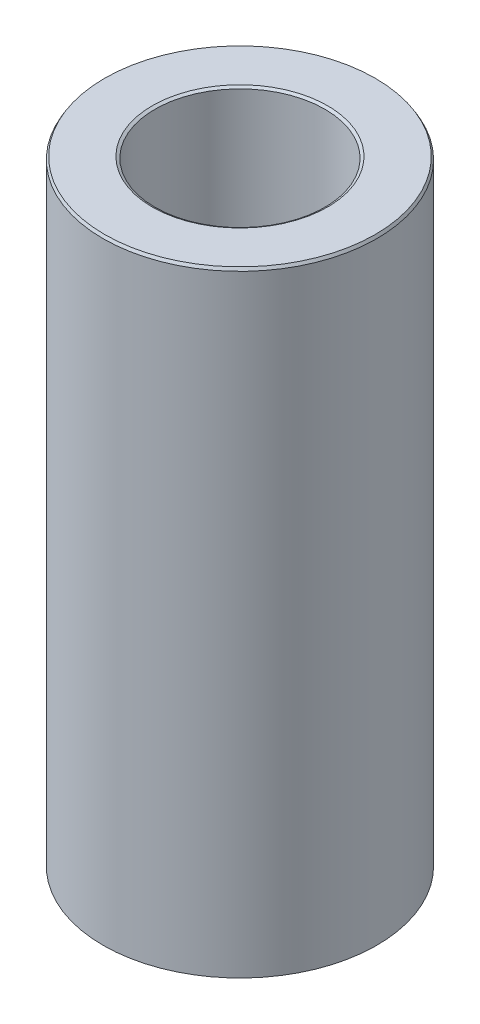
ISO-10303-21;
HEADER;
FILE_DESCRIPTION(('STEP AP214'),'2;1');
FILE_NAME('part.step','',(''),(''),'','','');
FILE_SCHEMA(('AUTOMOTIVE_DESIGN { 1 0 10303 214 1 1 1 1 }'));
ENDSEC;
DATA;
#1=APPLICATION_CONTEXT('core data for automotive mechanical design processes');
#2=APPLICATION_PROTOCOL_DEFINITION('international standard','automotive_design',2000,#1);
#3=PRODUCT_CONTEXT('',#1,'mechanical');
#4=PRODUCT('Part','Part','',(#3));
#5=PRODUCT_RELATED_PRODUCT_CATEGORY('part','',(#4));
#6=PRODUCT_DEFINITION_FORMATION('','',#4);
#7=PRODUCT_DEFINITION_CONTEXT('part definition',#1,'design');
#8=PRODUCT_DEFINITION('design','',#6,#7);
#9=PRODUCT_DEFINITION_SHAPE('','',#8);
#10=(LENGTH_UNIT() NAMED_UNIT(*) SI_UNIT(.MILLI.,.METRE.));
#11=(NAMED_UNIT(*) PLANE_ANGLE_UNIT() SI_UNIT($,.RADIAN.));
#12=(NAMED_UNIT(*) SI_UNIT($,.STERADIAN.) SOLID_ANGLE_UNIT());
#13=UNCERTAINTY_MEASURE_WITH_UNIT(LENGTH_MEASURE(1.E-05),#10,'distance_accuracy_value','');
#14=(GEOMETRIC_REPRESENTATION_CONTEXT(3) GLOBAL_UNCERTAINTY_ASSIGNED_CONTEXT((#13)) GLOBAL_UNIT_ASSIGNED_CONTEXT((#10,
#11,#12)) REPRESENTATION_CONTEXT('',''));
#15=CARTESIAN_POINT('',(0.,0.,0.));
#16=DIRECTION('',(0.,0.,1.));
#17=DIRECTION('',(1.,0.,0.));
#18=AXIS2_PLACEMENT_3D('',#15,#16,#17);
#19=CARTESIAN_POINT('',(0.,270.104100479233,0.));
#20=DIRECTION('',(0.,-1.,0.));
#21=DIRECTION('',(0.,0.,-1.));
#22=AXIS2_PLACEMENT_3D('',#19,#20,#21);
#23=CYLINDRICAL_SURFACE('',#22,60.);
#24=CARTESIAN_POINT('',(0.,0.701481861637765,0.));
#25=DIRECTION('',(0.,1.,0.));
#26=DIRECTION('',(0.,0.,1.));
#27=AXIS2_PLACEMENT_3D('',#24,#25,#26);
#28=CIRCLE('',#27,60.);
#29=CARTESIAN_POINT('',(0.,0.701481861637765,60.));
#30=VERTEX_POINT('',#29);
#31=EDGE_CURVE('E10',#30,#30,#28,.T.);
#32=ORIENTED_EDGE('',*,*,#31,.T.);
#33=EDGE_LOOP('',(#32));
#34=FACE_BOUND('',#33,.T.);
#35=CARTESIAN_POINT('',(0.,268.889098254288,0.));
#36=DIRECTION('',(0.,1.,0.));
#37=DIRECTION('',(0.,0.,1.));
#38=AXIS2_PLACEMENT_3D('',#35,#36,#37);
#39=CIRCLE('',#38,60.);
#40=CARTESIAN_POINT('',(0.,268.889098254288,60.));
#41=VERTEX_POINT('',#40);
#42=EDGE_CURVE('E50',#41,#41,#39,.F.);
#43=ORIENTED_EDGE('',*,*,#42,.T.);
#44=EDGE_LOOP('',(#43));
#45=FACE_BOUND('',#44,.T.);
#46=ADVANCED_FACE('F39',(#34,#45),#23,.T.);
#47=CARTESIAN_POINT('',(0.,270.104100479233,0.));
#48=DIRECTION('',(0.,1.,0.));
#49=DIRECTION('',(0.,0.,1.));
#50=AXIS2_PLACEMENT_3D('',#47,#48,#49);
#51=PLANE('',#50);
#52=CARTESIAN_POINT('',(0.,270.104100479233,0.));
#53=DIRECTION('',(0.,1.,0.));
#54=DIRECTION('',(0.,0.,1.));
#55=AXIS2_PLACEMENT_3D('',#52,#53,#54);
#56=CIRCLE('',#55,38.4465827836116);
#57=CARTESIAN_POINT('',(0.,270.104100479233,38.4465827836116));
#58=VERTEX_POINT('',#57);
#59=EDGE_CURVE('E58',#58,#58,#56,.F.);
#60=ORIENTED_EDGE('',*,*,#59,.T.);
#61=EDGE_LOOP('',(#60));
#62=FACE_BOUND('',#61,.T.);
#63=CARTESIAN_POINT('',(0.,270.104100479233,0.));
#64=DIRECTION('',(0.,1.,0.));
#65=DIRECTION('',(0.,0.,1.));
#66=AXIS2_PLACEMENT_3D('',#63,#64,#65);
#67=CIRCLE('',#66,59.2985181383622);
#68=CARTESIAN_POINT('',(0.,270.104100479233,59.2985181383622));
#69=VERTEX_POINT('',#68);
#70=EDGE_CURVE('E61',#69,#69,#67,.T.);
#71=ORIENTED_EDGE('',*,*,#70,.T.);
#72=EDGE_LOOP('',(#71));
#73=FACE_BOUND('',#72,.T.);
#74=ADVANCED_FACE('F88',(#62,#73),#51,.T.);
#75=CARTESIAN_POINT('',(0.,0.,0.));
#76=DIRECTION('',(0.,1.,0.));
#77=DIRECTION('',(0.,0.,1.));
#78=AXIS2_PLACEMENT_3D('',#75,#76,#77);
#79=PLANE('',#78);
#80=CARTESIAN_POINT('',(0.,0.,0.));
#81=DIRECTION('',(0.,1.,0.));
#82=DIRECTION('',(0.,0.,1.));
#83=AXIS2_PLACEMENT_3D('',#80,#81,#82);
#84=CIRCLE('',#83,37.9330624203047);
#85=CARTESIAN_POINT('',(0.,0.,37.9330624203047));
#86=VERTEX_POINT('',#85);
#87=EDGE_CURVE('E51',#86,#86,#84,.T.);
#88=ORIENTED_EDGE('',*,*,#87,.T.);
#89=EDGE_LOOP('',(#88));
#90=FACE_BOUND('',#89,.T.);
#91=CARTESIAN_POINT('',(0.,0.,0.));
#92=DIRECTION('',(0.,1.,0.));
#93=DIRECTION('',(0.,0.,1.));
#94=AXIS2_PLACEMENT_3D('',#91,#92,#93);
#95=CIRCLE('',#94,58.7849977750554);
#96=CARTESIAN_POINT('',(0.,0.,58.7849977750554));
#97=VERTEX_POINT('',#96);
#98=EDGE_CURVE('E54',#97,#97,#95,.F.);
#99=ORIENTED_EDGE('',*,*,#98,.T.);
#100=EDGE_LOOP('',(#99));
#101=FACE_BOUND('',#100,.T.);
#102=ADVANCED_FACE('F83',(#90,#101),#79,.F.);
#103=CARTESIAN_POINT('',(0.,270.104100479233,0.));
#104=DIRECTION('',(0.,-1.,0.));
#105=DIRECTION('',(0.,0.,-1.));
#106=AXIS2_PLACEMENT_3D('',#103,#104,#105);
#107=CYLINDRICAL_SURFACE('',#106,37.231580558667);
#108=CARTESIAN_POINT('',(0.,269.402618617595,0.));
#109=DIRECTION('',(0.,1.,0.));
#110=DIRECTION('',(0.,0.,1.));
#111=AXIS2_PLACEMENT_3D('',#108,#109,#110);
#112=CIRCLE('',#111,37.231580558667);
#113=CARTESIAN_POINT('',(0.,269.402618617595,37.231580558667));
#114=VERTEX_POINT('',#113);
#115=EDGE_CURVE('E67',#114,#114,#112,.T.);
#116=ORIENTED_EDGE('',*,*,#115,.T.);
#117=EDGE_LOOP('',(#116));
#118=FACE_BOUND('',#117,.T.);
#119=CARTESIAN_POINT('',(0.,1.21500222494458,0.));
#120=DIRECTION('',(0.,1.,0.));
#121=DIRECTION('',(0.,0.,1.));
#122=AXIS2_PLACEMENT_3D('',#119,#120,#121);
#123=CIRCLE('',#122,37.231580558667);
#124=CARTESIAN_POINT('',(0.,1.21500222494458,37.231580558667));
#125=VERTEX_POINT('',#124);
#126=EDGE_CURVE('E69',#125,#125,#123,.F.);
#127=ORIENTED_EDGE('',*,*,#126,.T.);
#128=EDGE_LOOP('',(#127));
#129=FACE_BOUND('',#128,.T.);
#130=ADVANCED_FACE('F71',(#118,#129),#107,.F.);
#131=CARTESIAN_POINT('',(0.,269.402618617595,0.));
#132=DIRECTION('',(0.,1.,0.));
#133=DIRECTION('',(0.,0.,1.));
#134=AXIS2_PLACEMENT_3D('',#131,#132,#133);
#135=CONICAL_SURFACE('',#134,37.231580558667,1.0471975511966);
#136=ORIENTED_EDGE('',*,*,#59,.F.);
#137=EDGE_LOOP('',(#136));
#138=FACE_BOUND('',#137,.T.);
#139=ORIENTED_EDGE('',*,*,#115,.F.);
#140=EDGE_LOOP('',(#139));
#141=FACE_BOUND('',#140,.T.);
#142=ADVANCED_FACE('F77',(#138,#141),#135,.F.);
#143=CARTESIAN_POINT('',(0.,0.,0.));
#144=DIRECTION('',(0.,-1.,0.));
#145=DIRECTION('',(0.,0.,-1.));
#146=AXIS2_PLACEMENT_3D('',#143,#144,#145);
#147=CONICAL_SURFACE('',#146,37.9330624203047,0.523598775598313);
#148=ORIENTED_EDGE('',*,*,#126,.F.);
#149=EDGE_LOOP('',(#148));
#150=FACE_BOUND('',#149,.T.);
#151=ORIENTED_EDGE('',*,*,#87,.F.);
#152=EDGE_LOOP('',(#151));
#153=FACE_BOUND('',#152,.T.);
#154=ADVANCED_FACE('F73',(#150,#153),#147,.F.);
#155=CARTESIAN_POINT('',(0.,0.701481861637765,0.));
#156=DIRECTION('',(0.,1.,0.));
#157=DIRECTION('',(0.,0.,1.));
#158=AXIS2_PLACEMENT_3D('',#155,#156,#157);
#159=CONICAL_SURFACE('',#158,60.,1.04719755119661);
#160=ORIENTED_EDGE('',*,*,#98,.F.);
#161=EDGE_LOOP('',(#160));
#162=FACE_BOUND('',#161,.T.);
#163=ORIENTED_EDGE('',*,*,#31,.F.);
#164=EDGE_LOOP('',(#163));
#165=FACE_BOUND('',#164,.T.);
#166=ADVANCED_FACE('F76',(#162,#165),#159,.T.);
#167=CARTESIAN_POINT('',(0.,270.104100479233,0.));
#168=DIRECTION('',(0.,-1.,0.));
#169=DIRECTION('',(0.,0.,-1.));
#170=AXIS2_PLACEMENT_3D('',#167,#168,#169);
#171=CONICAL_SURFACE('',#170,59.2985181383622,0.523598775598286);
#172=ORIENTED_EDGE('',*,*,#42,.F.);
#173=EDGE_LOOP('',(#172));
#174=FACE_BOUND('',#173,.T.);
#175=ORIENTED_EDGE('',*,*,#70,.F.);
#176=EDGE_LOOP('',(#175));
#177=FACE_BOUND('',#176,.T.);
#178=ADVANCED_FACE('F45',(#174,#177),#171,.T.);
#179=CLOSED_SHELL('',(#46,#74,#102,#130,#142,#154,#166,#178));
#180=MANIFOLD_SOLID_BREP('B2',#179);
#181=ADVANCED_BREP_SHAPE_REPRESENTATION('',(#18,#180),#14);
#182=SHAPE_DEFINITION_REPRESENTATION(#9,#181);
ENDSEC;
END-ISO-10303-21;
